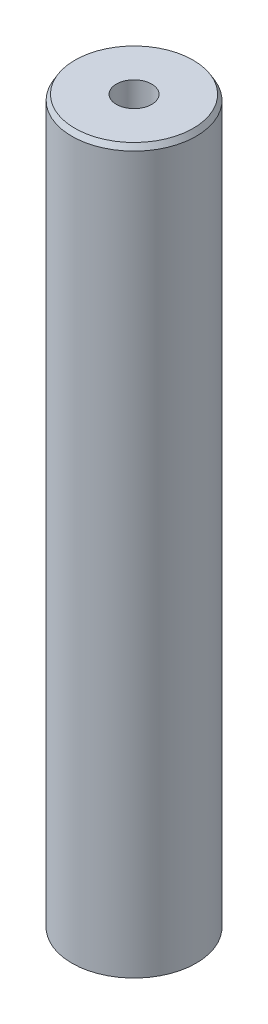
ISO-10303-21;
HEADER;
FILE_DESCRIPTION(('STEP AP214'),'2;1');
FILE_NAME('part.step','',(''),(''),'','','');
FILE_SCHEMA(('AUTOMOTIVE_DESIGN { 1 0 10303 214 1 1 1 1 }'));
ENDSEC;
DATA;
#1=APPLICATION_CONTEXT('core data for automotive mechanical design processes');
#2=APPLICATION_PROTOCOL_DEFINITION('international standard','automotive_design',2000,#1);
#3=PRODUCT_CONTEXT('',#1,'mechanical');
#4=PRODUCT('Part','Part','',(#3));
#5=PRODUCT_RELATED_PRODUCT_CATEGORY('part','',(#4));
#6=PRODUCT_DEFINITION_FORMATION('','',#4);
#7=PRODUCT_DEFINITION_CONTEXT('part definition',#1,'design');
#8=PRODUCT_DEFINITION('design','',#6,#7);
#9=PRODUCT_DEFINITION_SHAPE('','',#8);
#10=(LENGTH_UNIT() NAMED_UNIT(*) SI_UNIT(.MILLI.,.METRE.));
#11=(NAMED_UNIT(*) PLANE_ANGLE_UNIT() SI_UNIT($,.RADIAN.));
#12=(NAMED_UNIT(*) SI_UNIT($,.STERADIAN.) SOLID_ANGLE_UNIT());
#13=UNCERTAINTY_MEASURE_WITH_UNIT(LENGTH_MEASURE(1.E-05),#10,'distance_accuracy_value','');
#14=(GEOMETRIC_REPRESENTATION_CONTEXT(3) GLOBAL_UNCERTAINTY_ASSIGNED_CONTEXT((#13)) GLOBAL_UNIT_ASSIGNED_CONTEXT((#10,
#11,#12)) REPRESENTATION_CONTEXT('',''));
#15=CARTESIAN_POINT('',(0.,0.,0.));
#16=DIRECTION('',(0.,0.,1.));
#17=DIRECTION('',(1.,0.,0.));
#18=AXIS2_PLACEMENT_3D('',#15,#16,#17);
#19=CARTESIAN_POINT('',(0.,262.076035739825,0.));
#20=DIRECTION('',(0.,-1.,0.));
#21=DIRECTION('',(0.,0.,-1.));
#22=AXIS2_PLACEMENT_3D('',#19,#20,#21);
#23=CYLINDRICAL_SURFACE('',#22,22.5);
#24=CARTESIAN_POINT('',(0.,260.151018973239,0.));
#25=DIRECTION('',(0.,1.,0.));
#26=DIRECTION('',(0.,0.,1.));
#27=AXIS2_PLACEMENT_3D('',#24,#25,#26);
#28=CIRCLE('',#27,22.5);
#29=CARTESIAN_POINT('',(0.,260.151018973239,-22.5));
#30=VERTEX_POINT('',#29);
#31=EDGE_CURVE('E50',#30,#30,#28,.F.);
#32=ORIENTED_EDGE('',*,*,#31,.T.);
#33=EDGE_LOOP('',(#32));
#34=FACE_BOUND('',#33,.T.);
#35=CARTESIAN_POINT('',(0.,1.11140894838285,0.));
#36=DIRECTION('',(0.,1.,0.));
#37=DIRECTION('',(0.,0.,1.));
#38=AXIS2_PLACEMENT_3D('',#35,#36,#37);
#39=CIRCLE('',#38,22.5);
#40=CARTESIAN_POINT('',(0.,1.11140894838285,22.5));
#41=VERTEX_POINT('',#40);
#42=EDGE_CURVE('E51',#41,#41,#39,.T.);
#43=ORIENTED_EDGE('',*,*,#42,.T.);
#44=EDGE_LOOP('',(#43));
#45=FACE_BOUND('',#44,.T.);
#46=ADVANCED_FACE('F39',(#34,#45),#23,.T.);
#47=CARTESIAN_POINT('',(0.,262.076035739825,0.));
#48=DIRECTION('',(0.,1.,0.));
#49=DIRECTION('',(0.,0.,1.));
#50=AXIS2_PLACEMENT_3D('',#47,#48,#49);
#51=PLANE('',#50);
#52=CARTESIAN_POINT('',(0.,262.076035739825,0.));
#53=DIRECTION('',(0.,1.,0.));
#54=DIRECTION('',(0.,0.,1.));
#55=AXIS2_PLACEMENT_3D('',#52,#53,#54);
#56=CIRCLE('',#55,21.3885910516171);
#57=CARTESIAN_POINT('',(0.,262.076035739825,-21.3885910516171));
#58=VERTEX_POINT('',#57);
#59=EDGE_CURVE('E54',#58,#58,#56,.T.);
#60=ORIENTED_EDGE('',*,*,#59,.T.);
#61=EDGE_LOOP('',(#60));
#62=FACE_BOUND('',#61,.T.);
#63=CARTESIAN_POINT('',(0.,262.076035739825,0.));
#64=DIRECTION('',(0.,1.,0.));
#65=DIRECTION('',(0.,0.,1.));
#66=AXIS2_PLACEMENT_3D('',#63,#64,#65);
#67=CIRCLE('',#66,6.3951142756292);
#68=CARTESIAN_POINT('',(0.,262.076035739825,6.3951142756292));
#69=VERTEX_POINT('',#68);
#70=EDGE_CURVE('E58',#69,#69,#67,.T.);
#71=ORIENTED_EDGE('',*,*,#70,.F.);
#72=EDGE_LOOP('',(#71));
#73=FACE_BOUND('',#72,.T.);
#74=ADVANCED_FACE('F69',(#62,#73),#51,.T.);
#75=CARTESIAN_POINT('',(0.,0.,0.));
#76=DIRECTION('',(0.,1.,0.));
#77=DIRECTION('',(0.,0.,1.));
#78=AXIS2_PLACEMENT_3D('',#75,#76,#77);
#79=PLANE('',#78);
#80=CARTESIAN_POINT('',(0.,0.,0.));
#81=DIRECTION('',(0.,1.,0.));
#82=DIRECTION('',(0.,0.,1.));
#83=AXIS2_PLACEMENT_3D('',#80,#81,#82);
#84=CIRCLE('',#83,20.5749832334142);
#85=CARTESIAN_POINT('',(0.,0.,20.5749832334142));
#86=VERTEX_POINT('',#85);
#87=EDGE_CURVE('E10',#86,#86,#84,.F.);
#88=ORIENTED_EDGE('',*,*,#87,.T.);
#89=EDGE_LOOP('',(#88));
#90=FACE_BOUND('',#89,.T.);
#91=CARTESIAN_POINT('',(0.,0.,0.));
#92=DIRECTION('',(0.,1.,0.));
#93=DIRECTION('',(0.,0.,1.));
#94=AXIS2_PLACEMENT_3D('',#91,#92,#93);
#95=CIRCLE('',#94,6.3951142756292);
#96=CARTESIAN_POINT('',(0.,0.,6.3951142756292));
#97=VERTEX_POINT('',#96);
#98=EDGE_CURVE('E63',#97,#97,#95,.T.);
#99=ORIENTED_EDGE('',*,*,#98,.T.);
#100=EDGE_LOOP('',(#99));
#101=FACE_BOUND('',#100,.T.);
#102=ADVANCED_FACE('F75',(#90,#101),#79,.F.);
#103=CARTESIAN_POINT('',(0.,262.076035739825,0.));
#104=DIRECTION('',(0.,-1.,0.));
#105=DIRECTION('',(0.,0.,-1.));
#106=AXIS2_PLACEMENT_3D('',#103,#104,#105);
#107=CYLINDRICAL_SURFACE('',#106,6.3951142756292);
#108=ORIENTED_EDGE('',*,*,#70,.T.);
#109=EDGE_LOOP('',(#108));
#110=FACE_BOUND('',#109,.T.);
#111=ORIENTED_EDGE('',*,*,#98,.F.);
#112=EDGE_LOOP('',(#111));
#113=FACE_BOUND('',#112,.T.);
#114=ADVANCED_FACE('F70',(#110,#113),#107,.F.);
#115=CARTESIAN_POINT('',(0.,262.076035739825,0.));
#116=DIRECTION('',(0.,-1.,0.));
#117=DIRECTION('',(0.,0.,-1.));
#118=AXIS2_PLACEMENT_3D('',#115,#116,#117);
#119=CONICAL_SURFACE('',#118,21.3885910516171,0.5235987755983);
#120=CARTESIAN_POINT('',(0.,260.151018973239,-22.5));
#121=CARTESIAN_POINT('',(0.,260.171071231224,-22.4884228234544));
#122=CARTESIAN_POINT('',(0.,260.191123489209,-22.4768456469087));
#123=CARTESIAN_POINT('',(0.,260.23122800518,-22.4536912938174));
#124=CARTESIAN_POINT('',(0.,260.251280263165,-22.4421141172717));
#125=CARTESIAN_POINT('',(0.,260.291384779136,-22.4189597641804));
#126=CARTESIAN_POINT('',(0.,260.311437037121,-22.4073825876348));
#127=CARTESIAN_POINT('',(0.,260.351541553091,-22.3842282345435));
#128=CARTESIAN_POINT('',(0.,260.371593811077,-22.3726510579978));
#129=CARTESIAN_POINT('',(0.,260.411698327047,-22.3494967049065));
#130=CARTESIAN_POINT('',(0.,260.431750585032,-22.3379195283608));
#131=CARTESIAN_POINT('',(0.,260.471855101003,-22.3147651752695));
#132=CARTESIAN_POINT('',(0.,260.491907358988,-22.3031879987239));
#133=CARTESIAN_POINT('',(0.,260.532011874959,-22.2800336456326));
#134=CARTESIAN_POINT('',(0.,260.552064132944,-22.2684564690869));
#135=CARTESIAN_POINT('',(0.,260.592168648915,-22.2453021159956));
#136=CARTESIAN_POINT('',(0.,260.6122209069,-22.2337249394499));
#137=CARTESIAN_POINT('',(0.,260.65232542287,-22.2105705863586));
#138=CARTESIAN_POINT('',(0.,260.672377680856,-22.198993409813));
#139=CARTESIAN_POINT('',(0.,260.712482196826,-22.1758390567217));
#140=CARTESIAN_POINT('',(0.,260.732534454811,-22.164261880176));
#141=CARTESIAN_POINT('',(0.,260.772638970782,-22.1411075270847));
#142=CARTESIAN_POINT('',(0.,260.792691228767,-22.129530350539));
#143=CARTESIAN_POINT('',(0.,260.832795744738,-22.1063759974477));
#144=CARTESIAN_POINT('',(0.,260.852848002723,-22.0947988209021));
#145=CARTESIAN_POINT('',(0.,260.892952518694,-22.0716444678108));
#146=CARTESIAN_POINT('',(0.,260.913004776679,-22.0600672912651));
#147=CARTESIAN_POINT('',(0.,260.953109292649,-22.0369129381738));
#148=CARTESIAN_POINT('',(0.,260.973161550635,-22.0253357616281));
#149=CARTESIAN_POINT('',(0.,261.013266066605,-22.0021814085368));
#150=CARTESIAN_POINT('',(0.,261.03331832459,-21.9906042319912));
#151=CARTESIAN_POINT('',(0.,261.073422840561,-21.9674498788999));
#152=CARTESIAN_POINT('',(0.,261.093475098546,-21.9558727023542));
#153=CARTESIAN_POINT('',(0.,261.133579614517,-21.9327183492629));
#154=CARTESIAN_POINT('',(0.,261.153631872502,-21.9211411727172));
#155=CARTESIAN_POINT('',(0.,261.193736388473,-21.8979868196259));
#156=CARTESIAN_POINT('',(0.,261.213788646458,-21.8864096430803));
#157=CARTESIAN_POINT('',(0.,261.253893162428,-21.863255289989));
#158=CARTESIAN_POINT('',(0.,261.273945420414,-21.8516781134433));
#159=CARTESIAN_POINT('',(0.,261.314049936384,-21.828523760352));
#160=CARTESIAN_POINT('',(0.,261.33410219437,-21.8169465838064));
#161=CARTESIAN_POINT('',(0.,261.37420671034,-21.793792230715));
#162=CARTESIAN_POINT('',(0.,261.394258968325,-21.7822150541694));
#163=CARTESIAN_POINT('',(0.,261.434363484296,-21.7590607010781));
#164=CARTESIAN_POINT('',(0.,261.454415742281,-21.7474835245324));
#165=CARTESIAN_POINT('',(0.,261.494520258252,-21.7243291714411));
#166=CARTESIAN_POINT('',(0.,261.514572516237,-21.7127519948954));
#167=CARTESIAN_POINT('',(0.,261.554677032208,-21.6895976418041));
#168=CARTESIAN_POINT('',(0.,261.574729290193,-21.6780204652585));
#169=CARTESIAN_POINT('',(0.,261.614833806163,-21.6548661121672));
#170=CARTESIAN_POINT('',(0.,261.634886064149,-21.6432889356215));
#171=CARTESIAN_POINT('',(0.,261.674990580119,-21.6201345825302));
#172=CARTESIAN_POINT('',(0.,261.695042838104,-21.6085574059846));
#173=CARTESIAN_POINT('',(0.,261.735147354075,-21.5854030528932));
#174=CARTESIAN_POINT('',(0.,261.75519961206,-21.5738258763476));
#175=CARTESIAN_POINT('',(0.,261.795304128031,-21.5506715232563));
#176=CARTESIAN_POINT('',(0.,261.815356386016,-21.5390943467106));
#177=CARTESIAN_POINT('',(0.,261.855460901987,-21.5159399936193));
#178=CARTESIAN_POINT('',(0.,261.875513159972,-21.5043628170737));
#179=CARTESIAN_POINT('',(0.,261.915617675942,-21.4812084639823));
#180=CARTESIAN_POINT('',(0.,261.935669933928,-21.4696312874367));
#181=CARTESIAN_POINT('',(0.,261.975774449898,-21.4464769343454));
#182=CARTESIAN_POINT('',(0.,261.995826707883,-21.4348997577997));
#183=CARTESIAN_POINT('',(0.,262.035931223854,-21.4117454047084));
#184=CARTESIAN_POINT('',(0.,262.055983481839,-21.4001682281628));
#185=CARTESIAN_POINT('',(0.,262.076035739825,-21.3885910516171));
#186=B_SPLINE_CURVE_WITH_KNOTS('',3,(#120,#121,#122,#123,#124,#125,#126,#127,#128,#129,#130,
#131,#132,#133,#134,#135,#136,#137,#138,#139,#140,#141,#142,#143,#144,#145,#146,#147,#148,#149,
#150,#151,#152,#153,#154,#155,#156,#157,#158,#159,#160,#161,#162,#163,#164,#165,#166,#167,#168,
#169,#170,#171,#172,#173,#174,#175,#176,#177,#178,#179,#180,#181,#182,#183,#184,#185),
.UNSPECIFIED.,.F.,.F.,(4,2,2,2,2,2,2,2,2,2,2,2,2,2,2,2,2,2,2,2,2,2,2,2,2,2,2,2,2,2,2,2,4),(0.,
0.0694630592739427,0.138926118547885,0.20838917782183,0.277852237095772,0.347315296369667,
0.41677835564361,0.486241414917552,0.555704474191495,0.625167533465438,0.694630592739332,
0.764093652013275,0.833556711287218,0.903019770561162,0.972482829835057,1.041945889109,
1.11140894838294,1.18087200765688,1.25033506693083,1.31979812620472,1.38926118547866,
1.45872424475261,1.52818730402655,1.59765036330045,1.66711342257439,1.73657648184833,
1.80603954112227,1.87550260039622,1.94496565967011,2.01442871894405,2.083891778218,
2.15335483749194,2.22281789676588),.UNSPECIFIED.);
#187=EDGE_CURVE('BSEAM81',#30,#58,#186,.T.);
#188=ORIENTED_EDGE('',*,*,#31,.F.);
#189=ORIENTED_EDGE('',*,*,#59,.F.);
#190=ORIENTED_EDGE('',*,*,#187,.T.);
#191=ORIENTED_EDGE('',*,*,#187,.F.);
#192=EDGE_LOOP('',(#188,#190,#189,#191));
#193=FACE_BOUND('',#192,.T.);
#194=ADVANCED_FACE('F81',(#193),#119,.T.);
#195=CARTESIAN_POINT('',(0.,1.11140894838285,0.));
#196=DIRECTION('',(0.,1.,0.));
#197=DIRECTION('',(0.,0.,1.));
#198=AXIS2_PLACEMENT_3D('',#195,#196,#197);
#199=CONICAL_SURFACE('',#198,22.5,1.04719755119661);
#200=ORIENTED_EDGE('',*,*,#87,.F.);
#201=EDGE_LOOP('',(#200));
#202=FACE_BOUND('',#201,.T.);
#203=ORIENTED_EDGE('',*,*,#42,.F.);
#204=EDGE_LOOP('',(#203));
#205=FACE_BOUND('',#204,.T.);
#206=ADVANCED_FACE('F45',(#202,#205),#199,.T.);
#207=CLOSED_SHELL('',(#46,#74,#102,#114,#194,#206));
#208=MANIFOLD_SOLID_BREP('B2',#207);
#209=ADVANCED_BREP_SHAPE_REPRESENTATION('',(#18,#208),#14);
#210=SHAPE_DEFINITION_REPRESENTATION(#9,#209);
ENDSEC;
END-ISO-10303-21;
